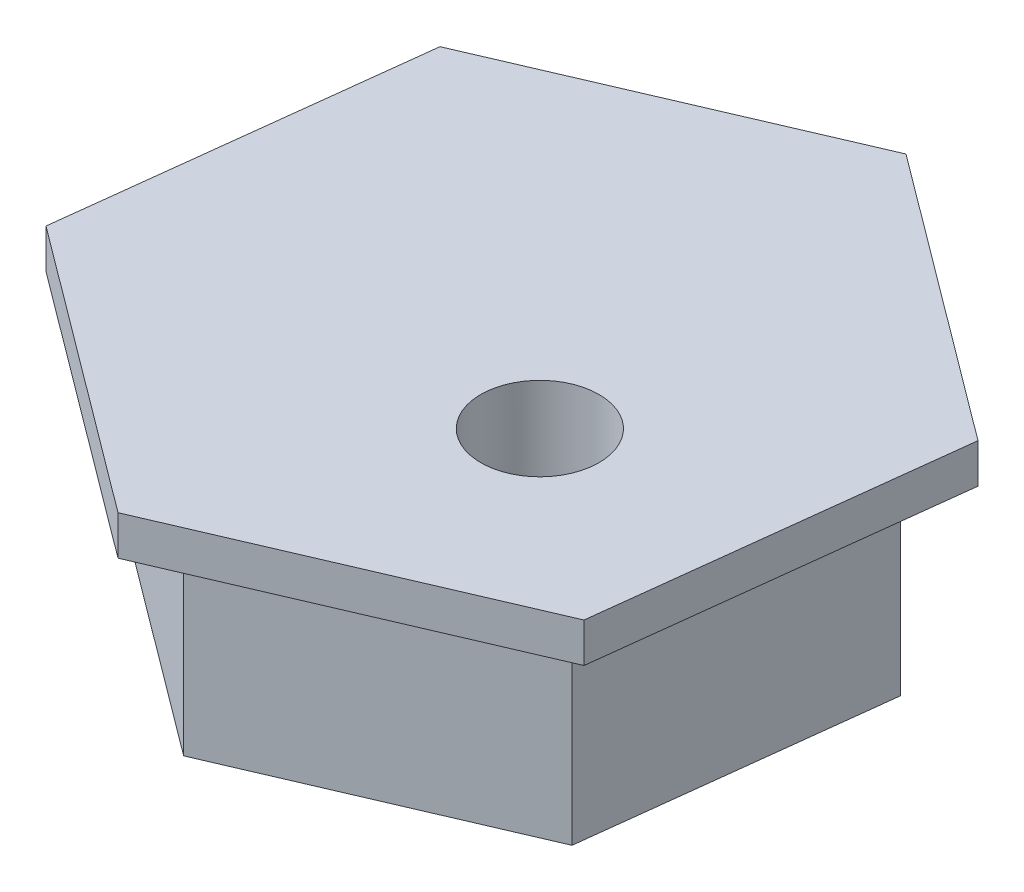
ISO-10303-21;
HEADER;
FILE_DESCRIPTION(('STEP AP214'),'2;1');
FILE_NAME('part.step','',(''),(''),'','','');
FILE_SCHEMA(('AUTOMOTIVE_DESIGN { 1 0 10303 214 1 1 1 1 }'));
ENDSEC;
DATA;
#1=APPLICATION_CONTEXT('core data for automotive mechanical design processes');
#2=APPLICATION_PROTOCOL_DEFINITION('international standard','automotive_design',2000,#1);
#3=PRODUCT_CONTEXT('',#1,'mechanical');
#4=PRODUCT('Part','Part','',(#3));
#5=PRODUCT_RELATED_PRODUCT_CATEGORY('part','',(#4));
#6=PRODUCT_DEFINITION_FORMATION('','',#4);
#7=PRODUCT_DEFINITION_CONTEXT('part definition',#1,'design');
#8=PRODUCT_DEFINITION('design','',#6,#7);
#9=PRODUCT_DEFINITION_SHAPE('','',#8);
#10=(LENGTH_UNIT() NAMED_UNIT(*) SI_UNIT(.MILLI.,.METRE.));
#11=(NAMED_UNIT(*) PLANE_ANGLE_UNIT() SI_UNIT($,.RADIAN.));
#12=(NAMED_UNIT(*) SI_UNIT($,.STERADIAN.) SOLID_ANGLE_UNIT());
#13=UNCERTAINTY_MEASURE_WITH_UNIT(LENGTH_MEASURE(1.E-05),#10,'distance_accuracy_value','');
#14=(GEOMETRIC_REPRESENTATION_CONTEXT(3) GLOBAL_UNCERTAINTY_ASSIGNED_CONTEXT((#13)) GLOBAL_UNIT_ASSIGNED_CONTEXT((#10,
#11,#12)) REPRESENTATION_CONTEXT('',''));
#15=CARTESIAN_POINT('',(0.,0.,0.));
#16=DIRECTION('',(0.,0.,1.));
#17=DIRECTION('',(1.,0.,0.));
#18=AXIS2_PLACEMENT_3D('',#15,#16,#17);
#19=CARTESIAN_POINT('',(-3.88613745369424,6.,5.20436698273621));
#20=DIRECTION('',(0.598310001332869,0.,-0.801264714251827));
#21=DIRECTION('',(-0.801264714251827,0.,-0.598310001332869));
#22=AXIS2_PLACEMENT_3D('',#19,#20,#21);
#23=PLANE('',#22);
#24=DIRECTION('',(0.801264714251827,0.,0.598310001332869));
#25=VECTOR('',#24,1.);
#26=CARTESIAN_POINT('',(-3.88613745369424,5.,5.20436698273621));
#27=LINE('',#26,#25);
#28=CARTESIAN_POINT('',(-6.89088013213859,5.,2.96070447773795));
#29=VERTEX_POINT('',#28);
#30=CARTESIAN_POINT('',(-0.881394775249889,5.,7.44802948773447));
#31=VERTEX_POINT('',#30);
#32=EDGE_CURVE('E196',#29,#31,#27,.T.);
#33=ORIENTED_EDGE('',*,*,#32,.F.);
#34=DIRECTION('',(0.,-1.,0.));
#35=VECTOR('',#34,1.);
#36=CARTESIAN_POINT('',(-6.89088013213859,6.,2.96070447773795));
#37=LINE('',#36,#35);
#38=CARTESIAN_POINT('',(-6.89088013213859,0.,2.96070447773795));
#39=VERTEX_POINT('',#38);
#40=EDGE_CURVE('E220',#29,#39,#37,.T.);
#41=ORIENTED_EDGE('',*,*,#40,.T.);
#42=DIRECTION('',(0.801264714251827,0.,0.598310001332869));
#43=VECTOR('',#42,1.);
#44=CARTESIAN_POINT('',(-3.88613745369424,0.,5.20436698273621));
#45=LINE('',#44,#43);
#46=CARTESIAN_POINT('',(-0.881394775249889,0.,7.44802948773447));
#47=VERTEX_POINT('',#46);
#48=EDGE_CURVE('E202',#39,#47,#45,.T.);
#49=ORIENTED_EDGE('',*,*,#48,.T.);
#50=DIRECTION('',(0.,-1.,0.));
#51=VECTOR('',#50,1.);
#52=CARTESIAN_POINT('',(-0.881394775249889,6.,7.44802948773447));
#53=LINE('',#52,#51);
#54=EDGE_CURVE('E44',#31,#47,#53,.T.);
#55=ORIENTED_EDGE('',*,*,#54,.F.);
#56=EDGE_LOOP('',(#33,#41,#49,#55));
#57=FACE_BOUND('',#56,.T.);
#58=ADVANCED_FACE('F36',(#57),#23,.F.);
#59=CARTESIAN_POINT('',(2.56404529081941,6.,5.9676772488655));
#60=DIRECTION('',(-0.394760597031727,0.,-0.918784017618479));
#61=DIRECTION('',(-0.91878401761848,0.,0.394760597031727));
#62=AXIS2_PLACEMENT_3D('',#59,#60,#61);
#63=PLANE('',#62);
#64=DIRECTION('',(0.91878401761848,0.,-0.394760597031727));
#65=VECTOR('',#64,1.);
#66=CARTESIAN_POINT('',(2.56404529081941,5.,5.9676772488655));
#67=LINE('',#66,#65);
#68=CARTESIAN_POINT('',(6.00948535688871,5.,4.48732500999652));
#69=VERTEX_POINT('',#68);
#70=EDGE_CURVE('E51',#31,#69,#67,.T.);
#71=ORIENTED_EDGE('',*,*,#70,.F.);
#72=ORIENTED_EDGE('',*,*,#54,.T.);
#73=DIRECTION('',(0.918784017618479,0.,-0.394760597031727));
#74=VECTOR('',#73,1.);
#75=CARTESIAN_POINT('',(2.56404529081941,0.,5.9676772488655));
#76=LINE('',#75,#74);
#77=CARTESIAN_POINT('',(6.00948535688871,0.,4.48732500999652));
#78=VERTEX_POINT('',#77);
#79=EDGE_CURVE('E205',#47,#78,#76,.T.);
#80=ORIENTED_EDGE('',*,*,#79,.T.);
#81=DIRECTION('',(0.,-1.,0.));
#82=VECTOR('',#81,1.);
#83=CARTESIAN_POINT('',(6.00948535688871,6.,4.48732500999652));
#84=LINE('',#83,#82);
#85=EDGE_CURVE('E228',#69,#78,#84,.T.);
#86=ORIENTED_EDGE('',*,*,#85,.F.);
#87=EDGE_LOOP('',(#71,#72,#80,#86));
#88=FACE_BOUND('',#87,.T.);
#89=ADVANCED_FACE('F230',(#88),#63,.F.);
#90=CARTESIAN_POINT('',(6.45018274451365,6.,0.76331026612928));
#91=DIRECTION('',(-0.993070598364596,0.,-0.117519303366652));
#92=DIRECTION('',(-0.117519303366652,0.,0.993070598364596));
#93=AXIS2_PLACEMENT_3D('',#90,#91,#92);
#94=PLANE('',#93);
#95=DIRECTION('',(0.117519303366652,0.,-0.993070598364596));
#96=VECTOR('',#95,1.);
#97=CARTESIAN_POINT('',(6.45018274451365,5.,0.76331026612928));
#98=LINE('',#97,#96);
#99=CARTESIAN_POINT('',(6.8908801321386,5.,-2.96070447773795));
#100=VERTEX_POINT('',#99);
#101=EDGE_CURVE('E59',#69,#100,#98,.T.);
#102=ORIENTED_EDGE('',*,*,#101,.F.);
#103=ORIENTED_EDGE('',*,*,#85,.T.);
#104=DIRECTION('',(0.117519303366652,0.,-0.993070598364596));
#105=VECTOR('',#104,1.);
#106=CARTESIAN_POINT('',(6.45018274451365,0.,0.76331026612928));
#107=LINE('',#106,#105);
#108=CARTESIAN_POINT('',(6.8908801321386,0.,-2.96070447773795));
#109=VERTEX_POINT('',#108);
#110=EDGE_CURVE('E208',#78,#109,#107,.T.);
#111=ORIENTED_EDGE('',*,*,#110,.T.);
#112=DIRECTION('',(0.,-1.,0.));
#113=VECTOR('',#112,1.);
#114=CARTESIAN_POINT('',(6.8908801321386,6.,-2.96070447773795));
#115=LINE('',#114,#113);
#116=EDGE_CURVE('E226',#100,#109,#115,.T.);
#117=ORIENTED_EDGE('',*,*,#116,.F.);
#118=EDGE_LOOP('',(#102,#103,#111,#117));
#119=FACE_BOUND('',#118,.T.);
#120=ADVANCED_FACE('F248',(#119),#94,.F.);
#121=CARTESIAN_POINT('',(3.88613745369424,6.,-5.20436698273621));
#122=DIRECTION('',(-0.598310001332869,0.,0.801264714251827));
#123=DIRECTION('',(0.801264714251827,0.,0.598310001332869));
#124=AXIS2_PLACEMENT_3D('',#121,#122,#123);
#125=PLANE('',#124);
#126=DIRECTION('',(-0.801264714251827,0.,-0.598310001332869));
#127=VECTOR('',#126,1.);
#128=CARTESIAN_POINT('',(3.88613745369424,5.,-5.20436698273621));
#129=LINE('',#128,#127);
#130=CARTESIAN_POINT('',(0.881394775249892,5.,-7.44802948773447));
#131=VERTEX_POINT('',#130);
#132=EDGE_CURVE('E191',#100,#131,#129,.T.);
#133=ORIENTED_EDGE('',*,*,#132,.F.);
#134=ORIENTED_EDGE('',*,*,#116,.T.);
#135=DIRECTION('',(-0.801264714251827,0.,-0.598310001332869));
#136=VECTOR('',#135,1.);
#137=CARTESIAN_POINT('',(3.88613745369424,0.,-5.20436698273621));
#138=LINE('',#137,#136);
#139=CARTESIAN_POINT('',(0.881394775249892,0.,-7.44802948773447));
#140=VERTEX_POINT('',#139);
#141=EDGE_CURVE('E211',#109,#140,#138,.T.);
#142=ORIENTED_EDGE('',*,*,#141,.T.);
#143=DIRECTION('',(0.,-1.,0.));
#144=VECTOR('',#143,1.);
#145=CARTESIAN_POINT('',(0.881394775249892,6.,-7.44802948773447));
#146=LINE('',#145,#144);
#147=EDGE_CURVE('E224',#131,#140,#146,.T.);
#148=ORIENTED_EDGE('',*,*,#147,.F.);
#149=EDGE_LOOP('',(#133,#134,#142,#148));
#150=FACE_BOUND('',#149,.T.);
#151=ADVANCED_FACE('F247',(#150),#125,.F.);
#152=CARTESIAN_POINT('',(-2.56404529081941,6.,-5.96767724886549));
#153=DIRECTION('',(0.394760597031727,0.,0.918784017618479));
#154=DIRECTION('',(0.91878401761848,0.,-0.394760597031727));
#155=AXIS2_PLACEMENT_3D('',#152,#153,#154);
#156=PLANE('',#155);
#157=DIRECTION('',(-0.91878401761848,0.,0.394760597031727));
#158=VECTOR('',#157,1.);
#159=CARTESIAN_POINT('',(-2.56404529081941,5.,-5.96767724886549));
#160=LINE('',#159,#158);
#161=CARTESIAN_POINT('',(-6.0094853568887,5.,-4.48732500999652));
#162=VERTEX_POINT('',#161);
#163=EDGE_CURVE('E181',#131,#162,#160,.T.);
#164=ORIENTED_EDGE('',*,*,#163,.F.);
#165=ORIENTED_EDGE('',*,*,#147,.T.);
#166=DIRECTION('',(-0.918784017618479,0.,0.394760597031727));
#167=VECTOR('',#166,1.);
#168=CARTESIAN_POINT('',(-2.56404529081941,0.,-5.96767724886549));
#169=LINE('',#168,#167);
#170=CARTESIAN_POINT('',(-6.0094853568887,0.,-4.48732500999652));
#171=VERTEX_POINT('',#170);
#172=EDGE_CURVE('E214',#140,#171,#169,.T.);
#173=ORIENTED_EDGE('',*,*,#172,.T.);
#174=DIRECTION('',(0.,-1.,0.));
#175=VECTOR('',#174,1.);
#176=CARTESIAN_POINT('',(-6.0094853568887,6.,-4.48732500999652));
#177=LINE('',#176,#175);
#178=EDGE_CURVE('E222',#162,#171,#177,.T.);
#179=ORIENTED_EDGE('',*,*,#178,.F.);
#180=EDGE_LOOP('',(#164,#165,#173,#179));
#181=FACE_BOUND('',#180,.T.);
#182=ADVANCED_FACE('F244',(#181),#156,.F.);
#183=CARTESIAN_POINT('',(2.44567584284861,6.,1.73884147400104));
#184=DIRECTION('',(0.,-1.,0.));
#185=DIRECTION('',(0.,0.,-1.));
#186=AXIS2_PLACEMENT_3D('',#183,#184,#185);
#187=CYLINDRICAL_SURFACE('',#186,1.5);
#188=CARTESIAN_POINT('',(2.44567584284861,0.,1.73884147400104));
#189=DIRECTION('',(0.,1.,0.));
#190=DIRECTION('',(0.,0.,1.));
#191=AXIS2_PLACEMENT_3D('',#188,#189,#190);
#192=CIRCLE('',#191,1.5);
#193=CARTESIAN_POINT('',(2.44567584284861,0.,3.23884147400104));
#194=VERTEX_POINT('',#193);
#195=EDGE_CURVE('E199',#194,#194,#192,.T.);
#196=ORIENTED_EDGE('',*,*,#195,.F.);
#197=EDGE_LOOP('',(#196));
#198=FACE_BOUND('',#197,.T.);
#199=CARTESIAN_POINT('',(2.44567584284861,6.,1.73884147400104));
#200=DIRECTION('',(0.,-1.,0.));
#201=DIRECTION('',(0.,0.,-1.));
#202=AXIS2_PLACEMENT_3D('',#199,#200,#201);
#203=CIRCLE('',#202,1.49999999999982);
#204=CARTESIAN_POINT('',(2.44567584284861,6.,0.238841474001219));
#205=VERTEX_POINT('',#204);
#206=EDGE_CURVE('E159',#205,#205,#203,.T.);
#207=ORIENTED_EDGE('',*,*,#206,.F.);
#208=EDGE_LOOP('',(#207));
#209=FACE_BOUND('',#208,.T.);
#210=ADVANCED_FACE('F38',(#198,#209),#187,.F.);
#211=CARTESIAN_POINT('',(-6.45018274451365,6.,-0.763310266129281));
#212=DIRECTION('',(0.993070598364596,0.,0.117519303366652));
#213=DIRECTION('',(0.117519303366652,0.,-0.993070598364596));
#214=AXIS2_PLACEMENT_3D('',#211,#212,#213);
#215=PLANE('',#214);
#216=DIRECTION('',(-0.117519303366652,0.,0.993070598364596));
#217=VECTOR('',#216,1.);
#218=CARTESIAN_POINT('',(-6.45018274451365,5.,-0.763310266129281));
#219=LINE('',#218,#217);
#220=EDGE_CURVE('E11',#162,#29,#219,.T.);
#221=ORIENTED_EDGE('',*,*,#220,.F.);
#222=ORIENTED_EDGE('',*,*,#178,.T.);
#223=DIRECTION('',(-0.117519303366652,0.,0.993070598364596));
#224=VECTOR('',#223,1.);
#225=CARTESIAN_POINT('',(-6.45018274451365,0.,-0.763310266129281));
#226=LINE('',#225,#224);
#227=EDGE_CURVE('E217',#171,#39,#226,.T.);
#228=ORIENTED_EDGE('',*,*,#227,.T.);
#229=ORIENTED_EDGE('',*,*,#40,.F.);
#230=EDGE_LOOP('',(#221,#222,#228,#229));
#231=FACE_BOUND('',#230,.T.);
#232=ADVANCED_FACE('F240',(#231),#215,.F.);
#233=CARTESIAN_POINT('',(0.,0.,0.));
#234=DIRECTION('',(0.,1.,0.));
#235=DIRECTION('',(0.,0.,1.));
#236=AXIS2_PLACEMENT_3D('',#233,#234,#235);
#237=PLANE('',#236);
#238=ORIENTED_EDGE('',*,*,#195,.T.);
#239=EDGE_LOOP('',(#238));
#240=FACE_BOUND('',#239,.T.);
#241=ORIENTED_EDGE('',*,*,#48,.F.);
#242=ORIENTED_EDGE('',*,*,#227,.F.);
#243=ORIENTED_EDGE('',*,*,#172,.F.);
#244=ORIENTED_EDGE('',*,*,#141,.F.);
#245=ORIENTED_EDGE('',*,*,#110,.F.);
#246=ORIENTED_EDGE('',*,*,#79,.F.);
#247=EDGE_LOOP('',(#241,#242,#243,#244,#245,#246));
#248=FACE_BOUND('',#247,.T.);
#249=ADVANCED_FACE('F236',(#240,#248),#237,.F.);
#250=CARTESIAN_POINT('',(8.26905615856631,5.,-3.55284537328555));
#251=DIRECTION('',(0.598310001332869,0.,-0.801264714251827));
#252=DIRECTION('',(-0.801264714251827,0.,-0.598310001332869));
#253=AXIS2_PLACEMENT_3D('',#250,#251,#252);
#254=PLANE('',#253);
#255=DIRECTION('',(-0.801264714251827,0.,-0.598310001332869));
#256=VECTOR('',#255,1.);
#257=CARTESIAN_POINT('',(8.26905615856631,6.,-3.55284537328555));
#258=LINE('',#257,#256);
#259=CARTESIAN_POINT('',(8.26905615856631,6.,-3.55284537328555));
#260=VERTEX_POINT('',#259);
#261=CARTESIAN_POINT('',(1.05767373029987,6.,-8.93763538528136));
#262=VERTEX_POINT('',#261);
#263=EDGE_CURVE('E131',#260,#262,#258,.T.);
#264=ORIENTED_EDGE('',*,*,#263,.F.);
#265=DIRECTION('',(0.,1.,0.));
#266=VECTOR('',#265,1.);
#267=CARTESIAN_POINT('',(8.26905615856631,5.,-3.55284537328555));
#268=LINE('',#267,#266);
#269=CARTESIAN_POINT('',(8.26905615856631,5.,-3.55284537328555));
#270=VERTEX_POINT('',#269);
#271=EDGE_CURVE('E126',#270,#260,#268,.T.);
#272=ORIENTED_EDGE('',*,*,#271,.F.);
#273=DIRECTION('',(-0.801264714251827,0.,-0.598310001332869));
#274=VECTOR('',#273,1.);
#275=CARTESIAN_POINT('',(8.26905615856631,5.,-3.55284537328555));
#276=LINE('',#275,#274);
#277=CARTESIAN_POINT('',(1.05767373029987,5.,-8.93763538528136));
#278=VERTEX_POINT('',#277);
#279=EDGE_CURVE('E129',#270,#278,#276,.T.);
#280=ORIENTED_EDGE('',*,*,#279,.T.);
#281=DIRECTION('',(0.,1.,0.));
#282=VECTOR('',#281,1.);
#283=CARTESIAN_POINT('',(1.05767373029987,5.,-8.93763538528136));
#284=LINE('',#283,#282);
#285=EDGE_CURVE('E136',#278,#262,#284,.T.);
#286=ORIENTED_EDGE('',*,*,#285,.T.);
#287=EDGE_LOOP('',(#264,#272,#280,#286));
#288=FACE_BOUND('',#287,.T.);
#289=ADVANCED_FACE('F128',(#288),#254,.T.);
#290=CARTESIAN_POINT('',(1.05767373029987,5.,-8.93763538528136));
#291=DIRECTION('',(-0.394760597031727,0.,-0.91878401761848));
#292=DIRECTION('',(-0.91878401761848,0.,0.394760597031727));
#293=AXIS2_PLACEMENT_3D('',#290,#291,#292);
#294=PLANE('',#293);
#295=DIRECTION('',(-0.918784017618479,0.,0.394760597031727));
#296=VECTOR('',#295,1.);
#297=CARTESIAN_POINT('',(1.05767373029987,6.,-8.93763538528136));
#298=LINE('',#297,#296);
#299=CARTESIAN_POINT('',(-7.21138242826645,6.,-5.38479001199582));
#300=VERTEX_POINT('',#299);
#301=EDGE_CURVE('E172',#262,#300,#298,.T.);
#302=ORIENTED_EDGE('',*,*,#301,.F.);
#303=ORIENTED_EDGE('',*,*,#285,.F.);
#304=DIRECTION('',(-0.918784017618479,0.,0.394760597031727));
#305=VECTOR('',#304,1.);
#306=CARTESIAN_POINT('',(1.05767373029987,5.,-8.93763538528136));
#307=LINE('',#306,#305);
#308=CARTESIAN_POINT('',(-7.21138242826645,5.,-5.38479001199582));
#309=VERTEX_POINT('',#308);
#310=EDGE_CURVE('E149',#278,#309,#307,.T.);
#311=ORIENTED_EDGE('',*,*,#310,.T.);
#312=DIRECTION('',(0.,1.,0.));
#313=VECTOR('',#312,1.);
#314=CARTESIAN_POINT('',(-7.21138242826645,5.,-5.38479001199582));
#315=LINE('',#314,#313);
#316=EDGE_CURVE('E186',#309,#300,#315,.T.);
#317=ORIENTED_EDGE('',*,*,#316,.T.);
#318=EDGE_LOOP('',(#302,#303,#311,#317));
#319=FACE_BOUND('',#318,.T.);
#320=ADVANCED_FACE('F280',(#319),#294,.T.);
#321=CARTESIAN_POINT('',(-7.21138242826645,5.,-5.38479001199582));
#322=DIRECTION('',(-0.993070598364596,0.,-0.117519303366652));
#323=DIRECTION('',(-0.117519303366652,0.,0.993070598364596));
#324=AXIS2_PLACEMENT_3D('',#321,#322,#323);
#325=PLANE('',#324);
#326=DIRECTION('',(-0.117519303366652,0.,0.993070598364596));
#327=VECTOR('',#326,1.);
#328=CARTESIAN_POINT('',(-7.21138242826645,6.,-5.38479001199582));
#329=LINE('',#328,#327);
#330=CARTESIAN_POINT('',(-8.26905615856631,6.,3.55284537328555));
#331=VERTEX_POINT('',#330);
#332=EDGE_CURVE('E175',#300,#331,#329,.T.);
#333=ORIENTED_EDGE('',*,*,#332,.F.);
#334=ORIENTED_EDGE('',*,*,#316,.F.);
#335=DIRECTION('',(-0.117519303366652,0.,0.993070598364596));
#336=VECTOR('',#335,1.);
#337=CARTESIAN_POINT('',(-7.21138242826645,5.,-5.38479001199582));
#338=LINE('',#337,#336);
#339=CARTESIAN_POINT('',(-8.26905615856631,5.,3.55284537328555));
#340=VERTEX_POINT('',#339);
#341=EDGE_CURVE('E162',#309,#340,#338,.T.);
#342=ORIENTED_EDGE('',*,*,#341,.T.);
#343=DIRECTION('',(0.,1.,0.));
#344=VECTOR('',#343,1.);
#345=CARTESIAN_POINT('',(-8.26905615856631,5.,3.55284537328555));
#346=LINE('',#345,#344);
#347=EDGE_CURVE('E184',#340,#331,#346,.T.);
#348=ORIENTED_EDGE('',*,*,#347,.T.);
#349=EDGE_LOOP('',(#333,#334,#342,#348));
#350=FACE_BOUND('',#349,.T.);
#351=ADVANCED_FACE('F283',(#350),#325,.T.);
#352=CARTESIAN_POINT('',(-8.26905615856631,5.,3.55284537328555));
#353=DIRECTION('',(-0.598310001332869,0.,0.801264714251827));
#354=DIRECTION('',(0.801264714251828,0.,0.598310001332869));
#355=AXIS2_PLACEMENT_3D('',#352,#353,#354);
#356=PLANE('',#355);
#357=DIRECTION('',(0.801264714251827,0.,0.598310001332869));
#358=VECTOR('',#357,1.);
#359=CARTESIAN_POINT('',(-8.26905615856631,6.,3.55284537328555));
#360=LINE('',#359,#358);
#361=CARTESIAN_POINT('',(-1.05767373029987,6.,8.93763538528136));
#362=VERTEX_POINT('',#361);
#363=EDGE_CURVE('E156',#331,#362,#360,.T.);
#364=ORIENTED_EDGE('',*,*,#363,.F.);
#365=ORIENTED_EDGE('',*,*,#347,.F.);
#366=DIRECTION('',(0.801264714251827,0.,0.598310001332869));
#367=VECTOR('',#366,1.);
#368=CARTESIAN_POINT('',(-8.26905615856631,5.,3.55284537328555));
#369=LINE('',#368,#367);
#370=CARTESIAN_POINT('',(-1.05767373029987,5.,8.93763538528136));
#371=VERTEX_POINT('',#370);
#372=EDGE_CURVE('E165',#340,#371,#369,.T.);
#373=ORIENTED_EDGE('',*,*,#372,.T.);
#374=DIRECTION('',(0.,1.,0.));
#375=VECTOR('',#374,1.);
#376=CARTESIAN_POINT('',(-1.05767373029987,5.,8.93763538528136));
#377=LINE('',#376,#375);
#378=EDGE_CURVE('E182',#371,#362,#377,.T.);
#379=ORIENTED_EDGE('',*,*,#378,.T.);
#380=EDGE_LOOP('',(#364,#365,#373,#379));
#381=FACE_BOUND('',#380,.T.);
#382=ADVANCED_FACE('F287',(#381),#356,.T.);
#383=CARTESIAN_POINT('',(-1.05767373029987,5.,8.93763538528136));
#384=DIRECTION('',(0.394760597031727,0.,0.91878401761848));
#385=DIRECTION('',(0.91878401761848,0.,-0.394760597031727));
#386=AXIS2_PLACEMENT_3D('',#383,#384,#385);
#387=PLANE('',#386);
#388=DIRECTION('',(0.918784017618479,0.,-0.394760597031727));
#389=VECTOR('',#388,1.);
#390=CARTESIAN_POINT('',(-1.05767373029987,6.,8.93763538528136));
#391=LINE('',#390,#389);
#392=CARTESIAN_POINT('',(7.21138242826645,6.,5.38479001199582));
#393=VERTEX_POINT('',#392);
#394=EDGE_CURVE('E153',#362,#393,#391,.T.);
#395=ORIENTED_EDGE('',*,*,#394,.F.);
#396=ORIENTED_EDGE('',*,*,#378,.F.);
#397=DIRECTION('',(0.918784017618479,0.,-0.394760597031727));
#398=VECTOR('',#397,1.);
#399=CARTESIAN_POINT('',(-1.05767373029987,5.,8.93763538528136));
#400=LINE('',#399,#398);
#401=CARTESIAN_POINT('',(7.21138242826645,5.,5.38479001199582));
#402=VERTEX_POINT('',#401);
#403=EDGE_CURVE('E137',#371,#402,#400,.T.);
#404=ORIENTED_EDGE('',*,*,#403,.T.);
#405=DIRECTION('',(0.,1.,0.));
#406=VECTOR('',#405,1.);
#407=CARTESIAN_POINT('',(7.21138242826645,5.,5.38479001199582));
#408=LINE('',#407,#406);
#409=EDGE_CURVE('E152',#402,#393,#408,.T.);
#410=ORIENTED_EDGE('',*,*,#409,.T.);
#411=EDGE_LOOP('',(#395,#396,#404,#410));
#412=FACE_BOUND('',#411,.T.);
#413=ADVANCED_FACE('F258',(#412),#387,.T.);
#414=CARTESIAN_POINT('',(7.21138242826645,5.,5.38479001199582));
#415=DIRECTION('',(0.993070598364596,0.,0.117519303366652));
#416=DIRECTION('',(0.117519303366652,0.,-0.993070598364596));
#417=AXIS2_PLACEMENT_3D('',#414,#415,#416);
#418=PLANE('',#417);
#419=DIRECTION('',(0.117519303366652,0.,-0.993070598364596));
#420=VECTOR('',#419,1.);
#421=CARTESIAN_POINT('',(7.21138242826645,6.,5.38479001199582));
#422=LINE('',#421,#420);
#423=EDGE_CURVE('E169',#393,#260,#422,.T.);
#424=ORIENTED_EDGE('',*,*,#423,.F.);
#425=ORIENTED_EDGE('',*,*,#409,.F.);
#426=DIRECTION('',(0.117519303366652,0.,-0.993070598364596));
#427=VECTOR('',#426,1.);
#428=CARTESIAN_POINT('',(7.21138242826645,5.,5.38479001199582));
#429=LINE('',#428,#427);
#430=EDGE_CURVE('E145',#402,#270,#429,.T.);
#431=ORIENTED_EDGE('',*,*,#430,.T.);
#432=ORIENTED_EDGE('',*,*,#271,.T.);
#433=EDGE_LOOP('',(#424,#425,#431,#432));
#434=FACE_BOUND('',#433,.T.);
#435=ADVANCED_FACE('F151',(#434),#418,.T.);
#436=CARTESIAN_POINT('',(0.,5.,0.));
#437=DIRECTION('',(0.,1.,0.));
#438=DIRECTION('',(0.,0.,1.));
#439=AXIS2_PLACEMENT_3D('',#436,#437,#438);
#440=PLANE('',#439);
#441=ORIENTED_EDGE('',*,*,#430,.F.);
#442=ORIENTED_EDGE('',*,*,#403,.F.);
#443=ORIENTED_EDGE('',*,*,#372,.F.);
#444=ORIENTED_EDGE('',*,*,#341,.F.);
#445=ORIENTED_EDGE('',*,*,#310,.F.);
#446=ORIENTED_EDGE('',*,*,#279,.F.);
#447=EDGE_LOOP('',(#441,#442,#443,#444,#445,#446));
#448=FACE_BOUND('',#447,.T.);
#449=ORIENTED_EDGE('',*,*,#220,.T.);
#450=ORIENTED_EDGE('',*,*,#32,.T.);
#451=ORIENTED_EDGE('',*,*,#70,.T.);
#452=ORIENTED_EDGE('',*,*,#101,.T.);
#453=ORIENTED_EDGE('',*,*,#132,.T.);
#454=ORIENTED_EDGE('',*,*,#163,.T.);
#455=EDGE_LOOP('',(#449,#450,#451,#452,#453,#454));
#456=FACE_BOUND('',#455,.T.);
#457=ADVANCED_FACE('F142',(#448,#456),#440,.F.);
#458=CARTESIAN_POINT('',(0.,6.,0.));
#459=DIRECTION('',(0.,1.,0.));
#460=DIRECTION('',(0.,0.,1.));
#461=AXIS2_PLACEMENT_3D('',#458,#459,#460);
#462=PLANE('',#461);
#463=ORIENTED_EDGE('',*,*,#206,.T.);
#464=EDGE_LOOP('',(#463));
#465=FACE_BOUND('',#464,.T.);
#466=ORIENTED_EDGE('',*,*,#423,.T.);
#467=ORIENTED_EDGE('',*,*,#263,.T.);
#468=ORIENTED_EDGE('',*,*,#301,.T.);
#469=ORIENTED_EDGE('',*,*,#332,.T.);
#470=ORIENTED_EDGE('',*,*,#363,.T.);
#471=ORIENTED_EDGE('',*,*,#394,.T.);
#472=EDGE_LOOP('',(#466,#467,#468,#469,#470,#471));
#473=FACE_BOUND('',#472,.T.);
#474=ADVANCED_FACE('F250',(#465,#473),#462,.T.);
#475=CLOSED_SHELL('',(#58,#89,#120,#151,#182,#210,#232,#249,#289,#320,#351,#382,#413,#435,#457,#474));
#476=MANIFOLD_SOLID_BREP('B2',#475);
#477=ADVANCED_BREP_SHAPE_REPRESENTATION('',(#18,#476),#14);
#478=SHAPE_DEFINITION_REPRESENTATION(#9,#477);
ENDSEC;
END-ISO-10303-21;
